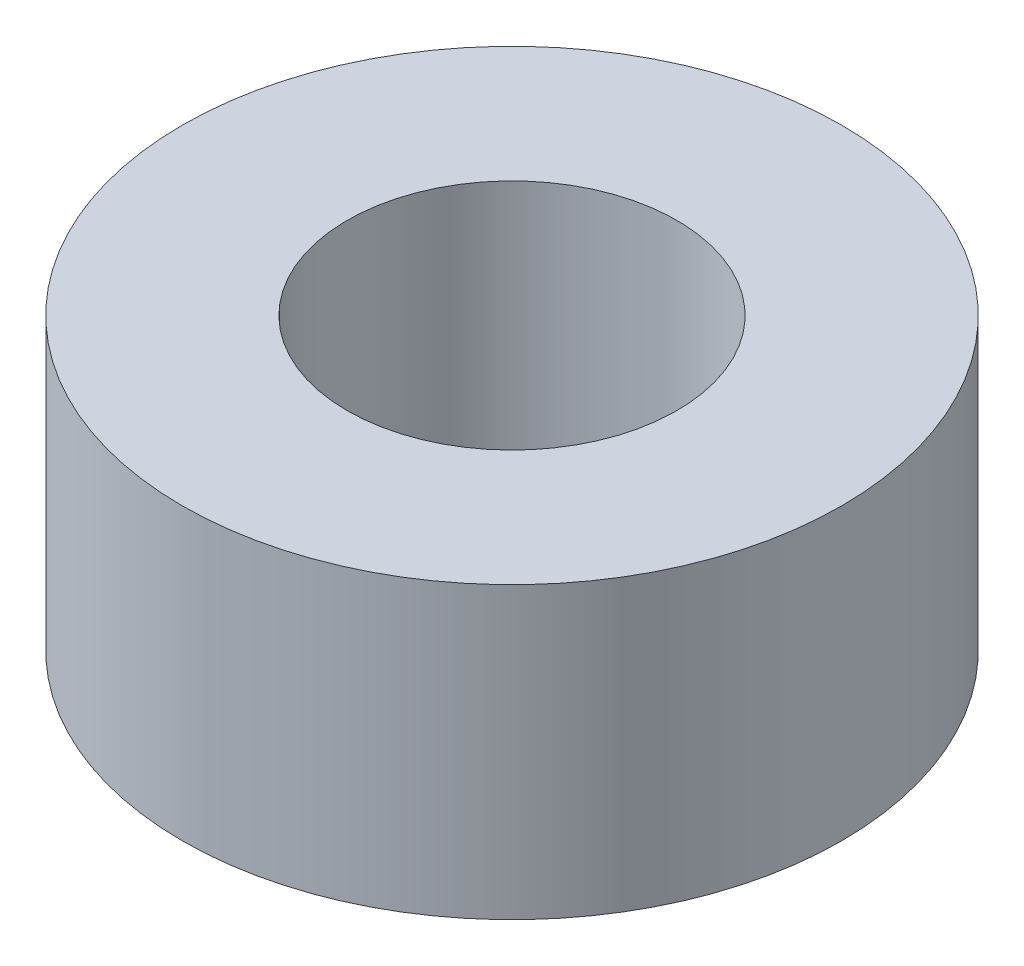
ISO-10303-21;
HEADER;
FILE_DESCRIPTION(('STEP AP214'),'2;1');
FILE_NAME('part.step','',(''),(''),'','','');
FILE_SCHEMA(('AUTOMOTIVE_DESIGN { 1 0 10303 214 1 1 1 1 }'));
ENDSEC;
DATA;
#1=APPLICATION_CONTEXT('core data for automotive mechanical design processes');
#2=APPLICATION_PROTOCOL_DEFINITION('international standard','automotive_design',2000,#1);
#3=PRODUCT_CONTEXT('',#1,'mechanical');
#4=PRODUCT('Part','Part','',(#3));
#5=PRODUCT_RELATED_PRODUCT_CATEGORY('part','',(#4));
#6=PRODUCT_DEFINITION_FORMATION('','',#4);
#7=PRODUCT_DEFINITION_CONTEXT('part definition',#1,'design');
#8=PRODUCT_DEFINITION('design','',#6,#7);
#9=PRODUCT_DEFINITION_SHAPE('','',#8);
#10=(LENGTH_UNIT() NAMED_UNIT(*) SI_UNIT(.MILLI.,.METRE.));
#11=(NAMED_UNIT(*) PLANE_ANGLE_UNIT() SI_UNIT($,.RADIAN.));
#12=(NAMED_UNIT(*) SI_UNIT($,.STERADIAN.) SOLID_ANGLE_UNIT());
#13=UNCERTAINTY_MEASURE_WITH_UNIT(LENGTH_MEASURE(1.E-05),#10,'distance_accuracy_value','');
#14=(GEOMETRIC_REPRESENTATION_CONTEXT(3) GLOBAL_UNCERTAINTY_ASSIGNED_CONTEXT((#13)) GLOBAL_UNIT_ASSIGNED_CONTEXT((#10,
#11,#12)) REPRESENTATION_CONTEXT('',''));
#15=CARTESIAN_POINT('',(0.,0.,0.));
#16=DIRECTION('',(0.,0.,1.));
#17=DIRECTION('',(1.,0.,0.));
#18=AXIS2_PLACEMENT_3D('',#15,#16,#17);
#19=CARTESIAN_POINT('',(0.,5.588,0.));
#20=DIRECTION('',(0.,1.,0.));
#21=DIRECTION('',(0.,0.,1.));
#22=AXIS2_PLACEMENT_3D('',#19,#20,#21);
#23=PLANE('',#22);
#24=CARTESIAN_POINT('',(0.,5.588,0.));
#25=DIRECTION('',(0.,1.,0.));
#26=DIRECTION('',(0.,0.,1.));
#27=AXIS2_PLACEMENT_3D('',#24,#25,#26);
#28=CIRCLE('',#27,6.35);
#29=CARTESIAN_POINT('',(0.,5.588,6.35));
#30=VERTEX_POINT('',#29);
#31=EDGE_CURVE('E10',#30,#30,#28,.T.);
#32=ORIENTED_EDGE('',*,*,#31,.T.);
#33=EDGE_LOOP('',(#32));
#34=FACE_BOUND('',#33,.T.);
#35=CARTESIAN_POINT('',(0.,5.588,0.));
#36=DIRECTION('',(0.,1.,0.));
#37=DIRECTION('',(0.,0.,1.));
#38=AXIS2_PLACEMENT_3D('',#35,#36,#37);
#39=CIRCLE('',#38,3.175);
#40=CARTESIAN_POINT('',(0.,5.588,3.175));
#41=VERTEX_POINT('',#40);
#42=EDGE_CURVE('E42',#41,#41,#39,.T.);
#43=ORIENTED_EDGE('',*,*,#42,.F.);
#44=EDGE_LOOP('',(#43));
#45=FACE_BOUND('',#44,.T.);
#46=ADVANCED_FACE('F31',(#34,#45),#23,.T.);
#47=CARTESIAN_POINT('',(0.,0.,0.));
#48=DIRECTION('',(0.,1.,0.));
#49=DIRECTION('',(0.,0.,1.));
#50=AXIS2_PLACEMENT_3D('',#47,#48,#49);
#51=PLANE('',#50);
#52=CARTESIAN_POINT('',(0.,0.,0.));
#53=DIRECTION('',(0.,1.,0.));
#54=DIRECTION('',(0.,0.,1.));
#55=AXIS2_PLACEMENT_3D('',#52,#53,#54);
#56=CIRCLE('',#55,6.35);
#57=CARTESIAN_POINT('',(0.,0.,6.35));
#58=VERTEX_POINT('',#57);
#59=EDGE_CURVE('E35',#58,#58,#56,.T.);
#60=ORIENTED_EDGE('',*,*,#59,.F.);
#61=EDGE_LOOP('',(#60));
#62=FACE_BOUND('',#61,.T.);
#63=CARTESIAN_POINT('',(0.,0.,0.));
#64=DIRECTION('',(0.,1.,0.));
#65=DIRECTION('',(0.,0.,1.));
#66=AXIS2_PLACEMENT_3D('',#63,#64,#65);
#67=CIRCLE('',#66,3.175);
#68=CARTESIAN_POINT('',(0.,0.,3.175));
#69=VERTEX_POINT('',#68);
#70=EDGE_CURVE('E44',#69,#69,#67,.T.);
#71=ORIENTED_EDGE('',*,*,#70,.T.);
#72=EDGE_LOOP('',(#71));
#73=FACE_BOUND('',#72,.T.);
#74=ADVANCED_FACE('F54',(#62,#73),#51,.F.);
#75=CARTESIAN_POINT('',(0.,5.588,0.));
#76=DIRECTION('',(0.,-1.,0.));
#77=DIRECTION('',(0.,0.,-1.));
#78=AXIS2_PLACEMENT_3D('',#75,#76,#77);
#79=CYLINDRICAL_SURFACE('',#78,6.35);
#80=ORIENTED_EDGE('',*,*,#31,.F.);
#81=EDGE_LOOP('',(#80));
#82=FACE_BOUND('',#81,.T.);
#83=ORIENTED_EDGE('',*,*,#59,.T.);
#84=EDGE_LOOP('',(#83));
#85=FACE_BOUND('',#84,.T.);
#86=ADVANCED_FACE('F33',(#82,#85),#79,.T.);
#87=CARTESIAN_POINT('',(0.,5.588,0.));
#88=DIRECTION('',(0.,-1.,0.));
#89=DIRECTION('',(0.,0.,-1.));
#90=AXIS2_PLACEMENT_3D('',#87,#88,#89);
#91=CYLINDRICAL_SURFACE('',#90,3.175);
#92=ORIENTED_EDGE('',*,*,#42,.T.);
#93=EDGE_LOOP('',(#92));
#94=FACE_BOUND('',#93,.T.);
#95=ORIENTED_EDGE('',*,*,#70,.F.);
#96=EDGE_LOOP('',(#95));
#97=FACE_BOUND('',#96,.T.);
#98=ADVANCED_FACE('F50',(#94,#97),#91,.F.);
#99=CLOSED_SHELL('',(#46,#74,#86,#98));
#100=MANIFOLD_SOLID_BREP('B2',#99);
#101=ADVANCED_BREP_SHAPE_REPRESENTATION('',(#18,#100),#14);
#102=SHAPE_DEFINITION_REPRESENTATION(#9,#101);
ENDSEC;
END-ISO-10303-21;
